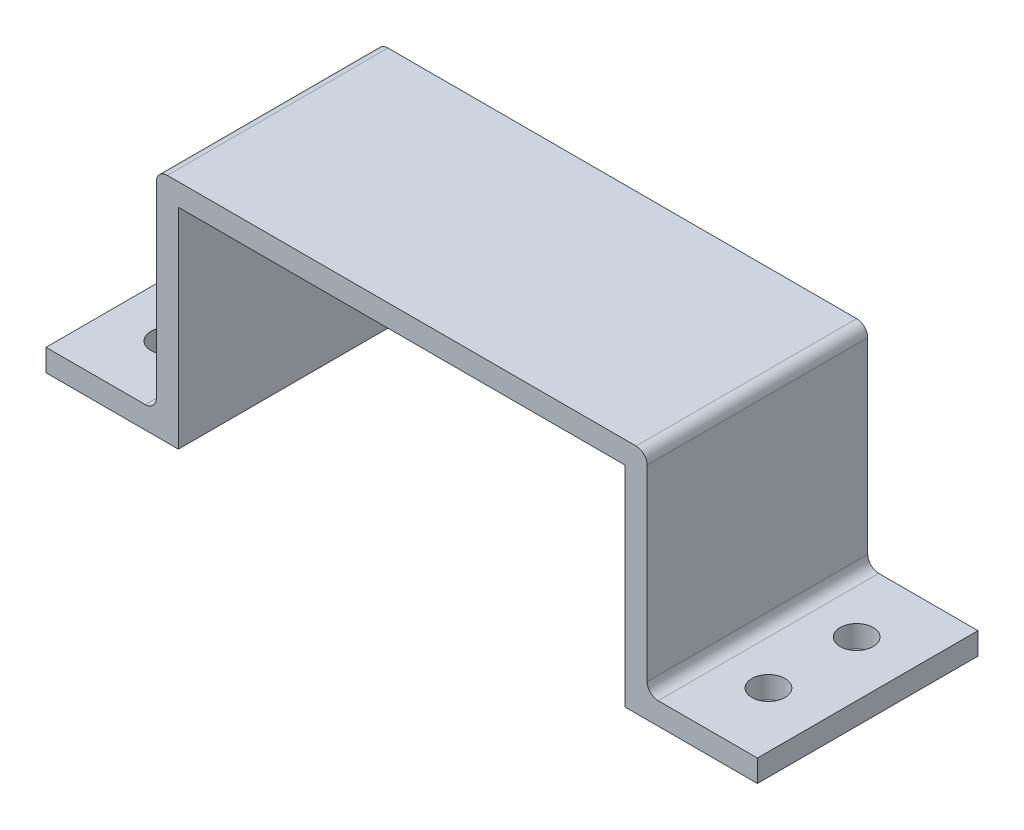
ISO-10303-21;
HEADER;
FILE_DESCRIPTION(('STEP AP214'),'2;1');
FILE_NAME('part.step','',(''),(''),'','','');
FILE_SCHEMA(('AUTOMOTIVE_DESIGN { 1 0 10303 214 1 1 1 1 }'));
ENDSEC;
DATA;
#1=APPLICATION_CONTEXT('core data for automotive mechanical design processes');
#2=APPLICATION_PROTOCOL_DEFINITION('international standard','automotive_design',2000,#1);
#3=PRODUCT_CONTEXT('',#1,'mechanical');
#4=PRODUCT('Part','Part','',(#3));
#5=PRODUCT_RELATED_PRODUCT_CATEGORY('part','',(#4));
#6=PRODUCT_DEFINITION_FORMATION('','',#4);
#7=PRODUCT_DEFINITION_CONTEXT('part definition',#1,'design');
#8=PRODUCT_DEFINITION('design','',#6,#7);
#9=PRODUCT_DEFINITION_SHAPE('','',#8);
#10=(LENGTH_UNIT() NAMED_UNIT(*) SI_UNIT(.MILLI.,.METRE.));
#11=(NAMED_UNIT(*) PLANE_ANGLE_UNIT() SI_UNIT($,.RADIAN.));
#12=(NAMED_UNIT(*) SI_UNIT($,.STERADIAN.) SOLID_ANGLE_UNIT());
#13=UNCERTAINTY_MEASURE_WITH_UNIT(LENGTH_MEASURE(1.E-05),#10,'distance_accuracy_value','');
#14=(GEOMETRIC_REPRESENTATION_CONTEXT(3) GLOBAL_UNCERTAINTY_ASSIGNED_CONTEXT((#13)) GLOBAL_UNIT_ASSIGNED_CONTEXT((#10,
#11,#12)) REPRESENTATION_CONTEXT('',''));
#15=CARTESIAN_POINT('',(0.,0.,0.));
#16=DIRECTION('',(0.,0.,1.));
#17=DIRECTION('',(1.,0.,0.));
#18=AXIS2_PLACEMENT_3D('',#15,#16,#17);
#19=CARTESIAN_POINT('',(-20.25,-1.11022302462516E-13,20.));
#20=DIRECTION('',(0.,1.,0.));
#21=DIRECTION('',(-1.,0.,0.));
#22=AXIS2_PLACEMENT_3D('',#19,#20,#21);
#23=PLANE('',#22);
#24=CARTESIAN_POINT('',(-27.25,-2.22044604925031E-13,5.9999999999998));
#25=DIRECTION('',(0.,1.,0.));
#26=DIRECTION('',(1.,0.,0.));
#27=AXIS2_PLACEMENT_3D('',#24,#25,#26);
#28=CIRCLE('',#27,1.5);
#29=CARTESIAN_POINT('',(-25.75,-2.2210965705538E-13,5.9999999999998));
#30=VERTEX_POINT('',#29);
#31=EDGE_CURVE('E307',#30,#30,#28,.T.);
#32=ORIENTED_EDGE('',*,*,#31,.T.);
#33=EDGE_LOOP('',(#32));
#34=FACE_BOUND('',#33,.T.);
#35=CARTESIAN_POINT('',(-27.2500000000001,-2.22044604925031E-13,13.9999999999998));
#36=DIRECTION('',(0.,1.,0.));
#37=DIRECTION('',(1.,0.,0.));
#38=AXIS2_PLACEMENT_3D('',#35,#36,#37);
#39=CIRCLE('',#38,1.5);
#40=CARTESIAN_POINT('',(-25.7500000000001,-2.2210965705538E-13,13.9999999999998));
#41=VERTEX_POINT('',#40);
#42=EDGE_CURVE('E313',#41,#41,#39,.T.);
#43=ORIENTED_EDGE('',*,*,#42,.T.);
#44=EDGE_LOOP('',(#43));
#45=FACE_BOUND('',#44,.T.);
#46=DIRECTION('',(1.,0.,0.));
#47=VECTOR('',#46,1.);
#48=CARTESIAN_POINT('',(-20.25,-1.11022302462516E-13,0.));
#49=LINE('',#48,#47);
#50=CARTESIAN_POINT('',(-32.25,-2.22044604925031E-13,0.));
#51=VERTEX_POINT('',#50);
#52=CARTESIAN_POINT('',(-20.25,-1.11022302462516E-13,0.));
#53=VERTEX_POINT('',#52);
#54=EDGE_CURVE('E169',#51,#53,#49,.T.);
#55=ORIENTED_EDGE('',*,*,#54,.T.);
#56=DIRECTION('',(0.,0.,-1.));
#57=VECTOR('',#56,1.);
#58=CARTESIAN_POINT('',(-20.25,-1.11022302462516E-13,20.));
#59=LINE('',#58,#57);
#60=CARTESIAN_POINT('',(-20.25,-1.11022302462516E-13,20.));
#61=VERTEX_POINT('',#60);
#62=EDGE_CURVE('E150',#61,#53,#59,.T.);
#63=ORIENTED_EDGE('',*,*,#62,.F.);
#64=DIRECTION('',(1.,0.,0.));
#65=VECTOR('',#64,1.);
#66=CARTESIAN_POINT('',(-20.25,-1.11022302462516E-13,20.));
#67=LINE('',#66,#65);
#68=CARTESIAN_POINT('',(-32.25,-2.22044604925031E-13,20.));
#69=VERTEX_POINT('',#68);
#70=EDGE_CURVE('E156',#69,#61,#67,.T.);
#71=ORIENTED_EDGE('',*,*,#70,.F.);
#72=DIRECTION('',(0.,0.,-1.));
#73=VECTOR('',#72,1.);
#74=CARTESIAN_POINT('',(-32.25,-2.22044604925031E-13,20.));
#75=LINE('',#74,#73);
#76=EDGE_CURVE('E243',#69,#51,#75,.T.);
#77=ORIENTED_EDGE('',*,*,#76,.T.);
#78=EDGE_LOOP('',(#55,#63,#71,#77));
#79=FACE_BOUND('',#78,.T.);
#80=ADVANCED_FACE('F33',(#34,#45,#79),#23,.F.);
#81=CARTESIAN_POINT('',(-20.2500000000001,18.9999999999999,20.));
#82=DIRECTION('',(-1.,0.,0.));
#83=DIRECTION('',(0.,-1.,0.));
#84=AXIS2_PLACEMENT_3D('',#81,#82,#83);
#85=PLANE('',#84);
#86=DIRECTION('',(0.,1.,0.));
#87=VECTOR('',#86,1.);
#88=CARTESIAN_POINT('',(-20.2500000000001,18.9999999999999,0.));
#89=LINE('',#88,#87);
#90=CARTESIAN_POINT('',(-20.2500000000001,18.9999999999999,0.));
#91=VERTEX_POINT('',#90);
#92=EDGE_CURVE('E245',#53,#91,#89,.T.);
#93=ORIENTED_EDGE('',*,*,#92,.T.);
#94=DIRECTION('',(0.,0.,-1.));
#95=VECTOR('',#94,1.);
#96=CARTESIAN_POINT('',(-20.2500000000001,18.9999999999999,20.));
#97=LINE('',#96,#95);
#98=CARTESIAN_POINT('',(-20.2500000000001,18.9999999999999,20.));
#99=VERTEX_POINT('',#98);
#100=EDGE_CURVE('E153',#99,#91,#97,.T.);
#101=ORIENTED_EDGE('',*,*,#100,.F.);
#102=DIRECTION('',(0.,1.,0.));
#103=VECTOR('',#102,1.);
#104=CARTESIAN_POINT('',(-20.2500000000001,18.9999999999999,20.));
#105=LINE('',#104,#103);
#106=EDGE_CURVE('E146',#61,#99,#105,.T.);
#107=ORIENTED_EDGE('',*,*,#106,.F.);
#108=ORIENTED_EDGE('',*,*,#62,.T.);
#109=EDGE_LOOP('',(#93,#101,#107,#108));
#110=FACE_BOUND('',#109,.T.);
#111=ADVANCED_FACE('F148',(#110),#85,.F.);
#112=CARTESIAN_POINT('',(-20.2500000000001,18.9999999999999,20.));
#113=DIRECTION('',(0.,1.,0.));
#114=DIRECTION('',(-1.,0.,0.));
#115=AXIS2_PLACEMENT_3D('',#112,#113,#114);
#116=PLANE('',#115);
#117=DIRECTION('',(1.,0.,0.));
#118=VECTOR('',#117,1.);
#119=CARTESIAN_POINT('',(-20.2500000000001,18.9999999999999,0.));
#120=LINE('',#119,#118);
#121=CARTESIAN_POINT('',(20.25,19.,0.));
#122=VERTEX_POINT('',#121);
#123=EDGE_CURVE('E248',#91,#122,#120,.T.);
#124=ORIENTED_EDGE('',*,*,#123,.T.);
#125=DIRECTION('',(0.,0.,-1.));
#126=VECTOR('',#125,1.);
#127=CARTESIAN_POINT('',(20.25,19.,20.));
#128=LINE('',#127,#126);
#129=CARTESIAN_POINT('',(20.25,19.,20.));
#130=VERTEX_POINT('',#129);
#131=EDGE_CURVE('E175',#130,#122,#128,.T.);
#132=ORIENTED_EDGE('',*,*,#131,.F.);
#133=DIRECTION('',(1.,0.,0.));
#134=VECTOR('',#133,1.);
#135=CARTESIAN_POINT('',(-20.2500000000001,18.9999999999999,20.));
#136=LINE('',#135,#134);
#137=EDGE_CURVE('E155',#99,#130,#136,.T.);
#138=ORIENTED_EDGE('',*,*,#137,.F.);
#139=ORIENTED_EDGE('',*,*,#100,.T.);
#140=EDGE_LOOP('',(#124,#132,#138,#139));
#141=FACE_BOUND('',#140,.T.);
#142=ADVANCED_FACE('F355',(#141),#116,.F.);
#143=CARTESIAN_POINT('',(20.25,19.,20.));
#144=DIRECTION('',(1.,0.,0.));
#145=DIRECTION('',(0.,0.,-1.));
#146=AXIS2_PLACEMENT_3D('',#143,#144,#145);
#147=PLANE('',#146);
#148=DIRECTION('',(0.,-1.,0.));
#149=VECTOR('',#148,1.);
#150=CARTESIAN_POINT('',(20.25,19.,0.));
#151=LINE('',#150,#149);
#152=CARTESIAN_POINT('',(20.25,0.,0.));
#153=VERTEX_POINT('',#152);
#154=EDGE_CURVE('E250',#122,#153,#151,.T.);
#155=ORIENTED_EDGE('',*,*,#154,.T.);
#156=DIRECTION('',(0.,0.,-1.));
#157=VECTOR('',#156,1.);
#158=CARTESIAN_POINT('',(20.25,0.,20.));
#159=LINE('',#158,#157);
#160=CARTESIAN_POINT('',(20.25,0.,20.));
#161=VERTEX_POINT('',#160);
#162=EDGE_CURVE('E273',#161,#153,#159,.T.);
#163=ORIENTED_EDGE('',*,*,#162,.F.);
#164=DIRECTION('',(0.,-1.,0.));
#165=VECTOR('',#164,1.);
#166=CARTESIAN_POINT('',(20.25,19.,20.));
#167=LINE('',#166,#165);
#168=EDGE_CURVE('E282',#130,#161,#167,.T.);
#169=ORIENTED_EDGE('',*,*,#168,.F.);
#170=ORIENTED_EDGE('',*,*,#131,.T.);
#171=EDGE_LOOP('',(#155,#163,#169,#170));
#172=FACE_BOUND('',#171,.T.);
#173=ADVANCED_FACE('F280',(#172),#147,.F.);
#174=CARTESIAN_POINT('',(20.25,0.,20.));
#175=DIRECTION('',(0.,1.,0.));
#176=DIRECTION('',(0.,0.,1.));
#177=AXIS2_PLACEMENT_3D('',#174,#175,#176);
#178=PLANE('',#177);
#179=CARTESIAN_POINT('',(27.25,-2.24646690138997E-13,14.));
#180=DIRECTION('',(0.,1.,0.));
#181=DIRECTION('',(-1.,0.,0.));
#182=AXIS2_PLACEMENT_3D('',#179,#180,#181);
#183=CIRCLE('',#182,1.5);
#184=CARTESIAN_POINT('',(25.75,-2.24581638008647E-13,14.));
#185=VERTEX_POINT('',#184);
#186=EDGE_CURVE('E301',#185,#185,#183,.T.);
#187=ORIENTED_EDGE('',*,*,#186,.T.);
#188=EDGE_LOOP('',(#187));
#189=FACE_BOUND('',#188,.T.);
#190=CARTESIAN_POINT('',(27.25,-2.24646690138997E-13,6.));
#191=DIRECTION('',(0.,1.,0.));
#192=DIRECTION('',(-1.,0.,0.));
#193=AXIS2_PLACEMENT_3D('',#190,#191,#192);
#194=CIRCLE('',#193,1.5);
#195=CARTESIAN_POINT('',(25.75,-2.24581638008647E-13,6.));
#196=VERTEX_POINT('',#195);
#197=EDGE_CURVE('E246',#196,#196,#194,.T.);
#198=ORIENTED_EDGE('',*,*,#197,.T.);
#199=EDGE_LOOP('',(#198));
#200=FACE_BOUND('',#199,.T.);
#201=DIRECTION('',(1.,0.,0.));
#202=VECTOR('',#201,1.);
#203=CARTESIAN_POINT('',(20.25,0.,0.));
#204=LINE('',#203,#202);
#205=CARTESIAN_POINT('',(32.25,0.,0.));
#206=VERTEX_POINT('',#205);
#207=EDGE_CURVE('E252',#153,#206,#204,.T.);
#208=ORIENTED_EDGE('',*,*,#207,.T.);
#209=DIRECTION('',(0.,0.,-1.));
#210=VECTOR('',#209,1.);
#211=CARTESIAN_POINT('',(32.25,0.,20.));
#212=LINE('',#211,#210);
#213=CARTESIAN_POINT('',(32.25,0.,20.));
#214=VERTEX_POINT('',#213);
#215=EDGE_CURVE('E270',#214,#206,#212,.T.);
#216=ORIENTED_EDGE('',*,*,#215,.F.);
#217=DIRECTION('',(1.,0.,0.));
#218=VECTOR('',#217,1.);
#219=CARTESIAN_POINT('',(20.25,0.,20.));
#220=LINE('',#219,#218);
#221=EDGE_CURVE('E293',#161,#214,#220,.T.);
#222=ORIENTED_EDGE('',*,*,#221,.F.);
#223=ORIENTED_EDGE('',*,*,#162,.T.);
#224=EDGE_LOOP('',(#208,#216,#222,#223));
#225=FACE_BOUND('',#224,.T.);
#226=ADVANCED_FACE('F288',(#189,#200,#225),#178,.F.);
#227=CARTESIAN_POINT('',(32.25,0.,20.));
#228=DIRECTION('',(-1.,0.,0.));
#229=DIRECTION('',(0.,0.,1.));
#230=AXIS2_PLACEMENT_3D('',#227,#228,#229);
#231=PLANE('',#230);
#232=DIRECTION('',(0.,1.,0.));
#233=VECTOR('',#232,1.);
#234=CARTESIAN_POINT('',(32.25,0.,0.));
#235=LINE('',#234,#233);
#236=CARTESIAN_POINT('',(32.25,2.,0.));
#237=VERTEX_POINT('',#236);
#238=EDGE_CURVE('E223',#206,#237,#235,.T.);
#239=ORIENTED_EDGE('',*,*,#238,.T.);
#240=DIRECTION('',(0.,0.,-1.));
#241=VECTOR('',#240,1.);
#242=CARTESIAN_POINT('',(32.25,2.,20.));
#243=LINE('',#242,#241);
#244=CARTESIAN_POINT('',(32.25,2.,20.));
#245=VERTEX_POINT('',#244);
#246=EDGE_CURVE('E222',#245,#237,#243,.T.);
#247=ORIENTED_EDGE('',*,*,#246,.F.);
#248=DIRECTION('',(0.,1.,0.));
#249=VECTOR('',#248,1.);
#250=CARTESIAN_POINT('',(32.25,0.,20.));
#251=LINE('',#250,#249);
#252=EDGE_CURVE('E234',#214,#245,#251,.T.);
#253=ORIENTED_EDGE('',*,*,#252,.F.);
#254=ORIENTED_EDGE('',*,*,#215,.T.);
#255=EDGE_LOOP('',(#239,#247,#253,#254));
#256=FACE_BOUND('',#255,.T.);
#257=ADVANCED_FACE('F292',(#256),#231,.F.);
#258=CARTESIAN_POINT('',(32.25,2.,20.));
#259=DIRECTION('',(0.,-1.,0.));
#260=DIRECTION('',(1.,0.,0.));
#261=AXIS2_PLACEMENT_3D('',#258,#259,#260);
#262=PLANE('',#261);
#263=CARTESIAN_POINT('',(27.25,2.,14.));
#264=DIRECTION('',(0.,1.,0.));
#265=DIRECTION('',(-1.,0.,0.));
#266=AXIS2_PLACEMENT_3D('',#263,#264,#265);
#267=CIRCLE('',#266,1.5);
#268=CARTESIAN_POINT('',(25.75,2.,14.));
#269=VERTEX_POINT('',#268);
#270=EDGE_CURVE('E316',#269,#269,#267,.T.);
#271=ORIENTED_EDGE('',*,*,#270,.F.);
#272=EDGE_LOOP('',(#271));
#273=FACE_BOUND('',#272,.T.);
#274=CARTESIAN_POINT('',(27.25,2.,6.));
#275=DIRECTION('',(0.,1.,0.));
#276=DIRECTION('',(-1.,0.,0.));
#277=AXIS2_PLACEMENT_3D('',#274,#275,#276);
#278=CIRCLE('',#277,1.5);
#279=CARTESIAN_POINT('',(25.75,2.,6.));
#280=VERTEX_POINT('',#279);
#281=EDGE_CURVE('E298',#280,#280,#278,.T.);
#282=ORIENTED_EDGE('',*,*,#281,.F.);
#283=EDGE_LOOP('',(#282));
#284=FACE_BOUND('',#283,.T.);
#285=DIRECTION('',(-1.,0.,0.));
#286=VECTOR('',#285,1.);
#287=CARTESIAN_POINT('',(32.25,2.,0.));
#288=LINE('',#287,#286);
#289=CARTESIAN_POINT('',(23.25,2.,0.));
#290=VERTEX_POINT('',#289);
#291=EDGE_CURVE('E212',#237,#290,#288,.T.);
#292=ORIENTED_EDGE('',*,*,#291,.T.);
#293=DIRECTION('',(0.,0.,-1.));
#294=VECTOR('',#293,1.);
#295=CARTESIAN_POINT('',(23.25,2.,20.));
#296=LINE('',#295,#294);
#297=CARTESIAN_POINT('',(23.25,2.,20.));
#298=VERTEX_POINT('',#297);
#299=EDGE_CURVE('E200',#290,#298,#296,.F.);
#300=ORIENTED_EDGE('',*,*,#299,.T.);
#301=DIRECTION('',(-1.,0.,0.));
#302=VECTOR('',#301,1.);
#303=CARTESIAN_POINT('',(32.25,2.,20.));
#304=LINE('',#303,#302);
#305=EDGE_CURVE('E230',#245,#298,#304,.T.);
#306=ORIENTED_EDGE('',*,*,#305,.F.);
#307=ORIENTED_EDGE('',*,*,#246,.T.);
#308=EDGE_LOOP('',(#292,#300,#306,#307));
#309=FACE_BOUND('',#308,.T.);
#310=ADVANCED_FACE('F219',(#273,#284,#309),#262,.F.);
#311=CARTESIAN_POINT('',(22.25,2.,20.));
#312=DIRECTION('',(-1.,0.,0.));
#313=DIRECTION('',(0.,0.,1.));
#314=AXIS2_PLACEMENT_3D('',#311,#312,#313);
#315=PLANE('',#314);
#316=DIRECTION('',(0.,1.,0.));
#317=VECTOR('',#316,1.);
#318=CARTESIAN_POINT('',(22.25,2.,20.));
#319=LINE('',#318,#317);
#320=CARTESIAN_POINT('',(22.25,3.,20.));
#321=VERTEX_POINT('',#320);
#322=CARTESIAN_POINT('',(22.25,20.,20.));
#323=VERTEX_POINT('',#322);
#324=EDGE_CURVE('E227',#321,#323,#319,.T.);
#325=ORIENTED_EDGE('',*,*,#324,.F.);
#326=DIRECTION('',(0.,0.,-1.));
#327=VECTOR('',#326,1.);
#328=CARTESIAN_POINT('',(22.25,3.,0.));
#329=LINE('',#328,#327);
#330=CARTESIAN_POINT('',(22.25,3.,0.));
#331=VERTEX_POINT('',#330);
#332=EDGE_CURVE('E197',#321,#331,#329,.T.);
#333=ORIENTED_EDGE('',*,*,#332,.T.);
#334=DIRECTION('',(0.,1.,0.));
#335=VECTOR('',#334,1.);
#336=CARTESIAN_POINT('',(22.25,2.,0.));
#337=LINE('',#336,#335);
#338=CARTESIAN_POINT('',(22.25,20.,0.));
#339=VERTEX_POINT('',#338);
#340=EDGE_CURVE('E213',#331,#339,#337,.T.);
#341=ORIENTED_EDGE('',*,*,#340,.T.);
#342=DIRECTION('',(0.,0.,-1.));
#343=VECTOR('',#342,1.);
#344=CARTESIAN_POINT('',(22.25,20.,20.));
#345=LINE('',#344,#343);
#346=EDGE_CURVE('E48',#339,#323,#345,.F.);
#347=ORIENTED_EDGE('',*,*,#346,.T.);
#348=EDGE_LOOP('',(#325,#333,#341,#347));
#349=FACE_BOUND('',#348,.T.);
#350=ADVANCED_FACE('F226',(#349),#315,.F.);
#351=CARTESIAN_POINT('',(22.25,21.,20.));
#352=DIRECTION('',(0.,-1.,0.));
#353=DIRECTION('',(1.,0.,0.));
#354=AXIS2_PLACEMENT_3D('',#351,#352,#353);
#355=PLANE('',#354);
#356=DIRECTION('',(-1.,0.,0.));
#357=VECTOR('',#356,1.);
#358=CARTESIAN_POINT('',(22.25,21.,0.));
#359=LINE('',#358,#357);
#360=CARTESIAN_POINT('',(21.25,21.,0.));
#361=VERTEX_POINT('',#360);
#362=CARTESIAN_POINT('',(-21.2500000000001,20.9999999999999,0.));
#363=VERTEX_POINT('',#362);
#364=EDGE_CURVE('E256',#361,#363,#359,.T.);
#365=ORIENTED_EDGE('',*,*,#364,.T.);
#366=DIRECTION('',(0.,0.,-1.));
#367=VECTOR('',#366,1.);
#368=CARTESIAN_POINT('',(-21.2500000000001,20.9999999999999,20.));
#369=LINE('',#368,#367);
#370=CARTESIAN_POINT('',(-21.2500000000001,20.9999999999999,20.));
#371=VERTEX_POINT('',#370);
#372=EDGE_CURVE('E190',#363,#371,#369,.F.);
#373=ORIENTED_EDGE('',*,*,#372,.T.);
#374=DIRECTION('',(-1.,0.,0.));
#375=VECTOR('',#374,1.);
#376=CARTESIAN_POINT('',(22.25,21.,20.));
#377=LINE('',#376,#375);
#378=CARTESIAN_POINT('',(21.25,21.,20.));
#379=VERTEX_POINT('',#378);
#380=EDGE_CURVE('E229',#379,#371,#377,.T.);
#381=ORIENTED_EDGE('',*,*,#380,.F.);
#382=DIRECTION('',(0.,0.,-1.));
#383=VECTOR('',#382,1.);
#384=CARTESIAN_POINT('',(21.25,21.,20.));
#385=LINE('',#384,#383);
#386=EDGE_CURVE('E187',#379,#361,#385,.T.);
#387=ORIENTED_EDGE('',*,*,#386,.T.);
#388=EDGE_LOOP('',(#365,#373,#381,#387));
#389=FACE_BOUND('',#388,.T.);
#390=ADVANCED_FACE('F377',(#389),#355,.F.);
#391=CARTESIAN_POINT('',(-22.25,1.99999999999989,20.));
#392=DIRECTION('',(1.,0.,0.));
#393=DIRECTION('',(0.,1.,0.));
#394=AXIS2_PLACEMENT_3D('',#391,#392,#393);
#395=PLANE('',#394);
#396=DIRECTION('',(0.,-1.,0.));
#397=VECTOR('',#396,1.);
#398=CARTESIAN_POINT('',(-22.25,1.99999999999989,0.));
#399=LINE('',#398,#397);
#400=CARTESIAN_POINT('',(-22.2500000000001,19.9999999999999,0.));
#401=VERTEX_POINT('',#400);
#402=CARTESIAN_POINT('',(-22.25,2.99999999999988,0.));
#403=VERTEX_POINT('',#402);
#404=EDGE_CURVE('E259',#401,#403,#399,.T.);
#405=ORIENTED_EDGE('',*,*,#404,.T.);
#406=DIRECTION('',(0.,0.,-1.));
#407=VECTOR('',#406,1.);
#408=CARTESIAN_POINT('',(-22.25,2.99999999999988,20.));
#409=LINE('',#408,#407);
#410=CARTESIAN_POINT('',(-22.25,2.99999999999988,20.));
#411=VERTEX_POINT('',#410);
#412=EDGE_CURVE('E181',#403,#411,#409,.F.);
#413=ORIENTED_EDGE('',*,*,#412,.T.);
#414=DIRECTION('',(0.,-1.,0.));
#415=VECTOR('',#414,1.);
#416=CARTESIAN_POINT('',(-22.25,1.99999999999989,20.));
#417=LINE('',#416,#415);
#418=CARTESIAN_POINT('',(-22.2500000000001,19.9999999999999,20.));
#419=VERTEX_POINT('',#418);
#420=EDGE_CURVE('E232',#419,#411,#417,.T.);
#421=ORIENTED_EDGE('',*,*,#420,.F.);
#422=DIRECTION('',(0.,0.,-1.));
#423=VECTOR('',#422,1.);
#424=CARTESIAN_POINT('',(-22.2500000000001,19.9999999999999,20.));
#425=LINE('',#424,#423);
#426=EDGE_CURVE('E173',#419,#401,#425,.T.);
#427=ORIENTED_EDGE('',*,*,#426,.T.);
#428=EDGE_LOOP('',(#405,#413,#421,#427));
#429=FACE_BOUND('',#428,.T.);
#430=ADVANCED_FACE('F384',(#429),#395,.F.);
#431=CARTESIAN_POINT('',(-32.25,1.99999999999978,20.));
#432=DIRECTION('',(0.,-1.,0.));
#433=DIRECTION('',(1.,0.,0.));
#434=AXIS2_PLACEMENT_3D('',#431,#432,#433);
#435=PLANE('',#434);
#436=CARTESIAN_POINT('',(-27.25,2.,5.9999999999998));
#437=DIRECTION('',(0.,1.,0.));
#438=DIRECTION('',(1.,0.,0.));
#439=AXIS2_PLACEMENT_3D('',#436,#437,#438);
#440=CIRCLE('',#439,1.5);
#441=CARTESIAN_POINT('',(-25.75,2.,5.9999999999998));
#442=VERTEX_POINT('',#441);
#443=EDGE_CURVE('E304',#442,#442,#440,.T.);
#444=ORIENTED_EDGE('',*,*,#443,.F.);
#445=EDGE_LOOP('',(#444));
#446=FACE_BOUND('',#445,.T.);
#447=CARTESIAN_POINT('',(-27.2500000000001,2.,13.9999999999998));
#448=DIRECTION('',(0.,1.,0.));
#449=DIRECTION('',(1.,0.,0.));
#450=AXIS2_PLACEMENT_3D('',#447,#448,#449);
#451=CIRCLE('',#450,1.5);
#452=CARTESIAN_POINT('',(-25.7500000000001,2.,13.9999999999998));
#453=VERTEX_POINT('',#452);
#454=EDGE_CURVE('E310',#453,#453,#451,.T.);
#455=ORIENTED_EDGE('',*,*,#454,.F.);
#456=EDGE_LOOP('',(#455));
#457=FACE_BOUND('',#456,.T.);
#458=DIRECTION('',(-1.,0.,0.));
#459=VECTOR('',#458,1.);
#460=CARTESIAN_POINT('',(-32.25,1.99999999999978,20.));
#461=LINE('',#460,#459);
#462=CARTESIAN_POINT('',(-23.25,1.99999999999988,20.));
#463=VERTEX_POINT('',#462);
#464=CARTESIAN_POINT('',(-32.25,1.99999999999978,20.));
#465=VERTEX_POINT('',#464);
#466=EDGE_CURVE('E240',#463,#465,#461,.T.);
#467=ORIENTED_EDGE('',*,*,#466,.F.);
#468=DIRECTION('',(0.,0.,-1.));
#469=VECTOR('',#468,1.);
#470=CARTESIAN_POINT('',(-23.25,1.99999999999988,0.));
#471=LINE('',#470,#469);
#472=CARTESIAN_POINT('',(-23.25,1.99999999999988,0.));
#473=VERTEX_POINT('',#472);
#474=EDGE_CURVE('E170',#463,#473,#471,.T.);
#475=ORIENTED_EDGE('',*,*,#474,.T.);
#476=DIRECTION('',(-1.,0.,0.));
#477=VECTOR('',#476,1.);
#478=CARTESIAN_POINT('',(-32.25,1.99999999999978,0.));
#479=LINE('',#478,#477);
#480=CARTESIAN_POINT('',(-32.25,1.99999999999978,0.));
#481=VERTEX_POINT('',#480);
#482=EDGE_CURVE('E262',#473,#481,#479,.T.);
#483=ORIENTED_EDGE('',*,*,#482,.T.);
#484=DIRECTION('',(0.,0.,-1.));
#485=VECTOR('',#484,1.);
#486=CARTESIAN_POINT('',(-32.25,1.99999999999978,20.));
#487=LINE('',#486,#485);
#488=EDGE_CURVE('E266',#465,#481,#487,.T.);
#489=ORIENTED_EDGE('',*,*,#488,.F.);
#490=EDGE_LOOP('',(#467,#475,#483,#489));
#491=FACE_BOUND('',#490,.T.);
#492=ADVANCED_FACE('F390',(#446,#457,#491),#435,.F.);
#493=CARTESIAN_POINT('',(-32.25,-2.22044604925031E-13,20.));
#494=DIRECTION('',(1.,0.,0.));
#495=DIRECTION('',(0.,1.,0.));
#496=AXIS2_PLACEMENT_3D('',#493,#494,#495);
#497=PLANE('',#496);
#498=DIRECTION('',(0.,-1.,0.));
#499=VECTOR('',#498,1.);
#500=CARTESIAN_POINT('',(-32.25,-2.22044604925031E-13,0.));
#501=LINE('',#500,#499);
#502=EDGE_CURVE('E166',#481,#51,#501,.T.);
#503=ORIENTED_EDGE('',*,*,#502,.T.);
#504=ORIENTED_EDGE('',*,*,#76,.F.);
#505=DIRECTION('',(0.,-1.,0.));
#506=VECTOR('',#505,1.);
#507=CARTESIAN_POINT('',(-32.25,-2.22044604925031E-13,20.));
#508=LINE('',#507,#506);
#509=EDGE_CURVE('E162',#465,#69,#508,.T.);
#510=ORIENTED_EDGE('',*,*,#509,.F.);
#511=ORIENTED_EDGE('',*,*,#488,.T.);
#512=EDGE_LOOP('',(#503,#504,#510,#511));
#513=FACE_BOUND('',#512,.T.);
#514=ADVANCED_FACE('F394',(#513),#497,.F.);
#515=CARTESIAN_POINT('',(0.,0.,20.));
#516=DIRECTION('',(0.,0.,-1.));
#517=DIRECTION('',(-1.,0.,0.));
#518=AXIS2_PLACEMENT_3D('',#515,#516,#517);
#519=PLANE('',#518);
#520=ORIENTED_EDGE('',*,*,#380,.T.);
#521=CARTESIAN_POINT('',(-21.2500000000001,19.9999999999999,20.));
#522=DIRECTION('',(0.,0.,-1.));
#523=DIRECTION('',(-1.,0.,0.));
#524=AXIS2_PLACEMENT_3D('',#521,#522,#523);
#525=CIRCLE('',#524,1.);
#526=EDGE_CURVE('E194',#371,#419,#525,.F.);
#527=ORIENTED_EDGE('',*,*,#526,.T.);
#528=ORIENTED_EDGE('',*,*,#420,.T.);
#529=CARTESIAN_POINT('',(-23.25,2.99999999999988,20.));
#530=DIRECTION('',(0.,0.,-1.));
#531=DIRECTION('',(-1.,0.,0.));
#532=AXIS2_PLACEMENT_3D('',#529,#530,#531);
#533=CIRCLE('',#532,1.);
#534=EDGE_CURVE('E204',#411,#463,#533,.T.);
#535=ORIENTED_EDGE('',*,*,#534,.T.);
#536=ORIENTED_EDGE('',*,*,#466,.T.);
#537=ORIENTED_EDGE('',*,*,#509,.T.);
#538=ORIENTED_EDGE('',*,*,#70,.T.);
#539=ORIENTED_EDGE('',*,*,#106,.T.);
#540=ORIENTED_EDGE('',*,*,#137,.T.);
#541=ORIENTED_EDGE('',*,*,#168,.T.);
#542=ORIENTED_EDGE('',*,*,#221,.T.);
#543=ORIENTED_EDGE('',*,*,#252,.T.);
#544=ORIENTED_EDGE('',*,*,#305,.T.);
#545=CARTESIAN_POINT('',(23.25,3.,20.));
#546=DIRECTION('',(0.,0.,-1.));
#547=DIRECTION('',(-1.,0.,0.));
#548=AXIS2_PLACEMENT_3D('',#545,#546,#547);
#549=CIRCLE('',#548,1.);
#550=EDGE_CURVE('E11',#298,#321,#549,.T.);
#551=ORIENTED_EDGE('',*,*,#550,.T.);
#552=ORIENTED_EDGE('',*,*,#324,.T.);
#553=CARTESIAN_POINT('',(21.25,20.,20.));
#554=DIRECTION('',(0.,0.,-1.));
#555=DIRECTION('',(-1.,0.,0.));
#556=AXIS2_PLACEMENT_3D('',#553,#554,#555);
#557=CIRCLE('',#556,1.);
#558=EDGE_CURVE('E192',#323,#379,#557,.F.);
#559=ORIENTED_EDGE('',*,*,#558,.T.);
#560=EDGE_LOOP('',(#520,#527,#528,#535,#536,#537,#538,#539,#540,#541,#542,#543,#544,#551,#552,#559));
#561=FACE_BOUND('',#560,.T.);
#562=ADVANCED_FACE('F160',(#561),#519,.F.);
#563=CARTESIAN_POINT('',(0.,0.,0.));
#564=DIRECTION('',(0.,0.,-1.));
#565=DIRECTION('',(-1.,0.,0.));
#566=AXIS2_PLACEMENT_3D('',#563,#564,#565);
#567=PLANE('',#566);
#568=ORIENTED_EDGE('',*,*,#404,.F.);
#569=CARTESIAN_POINT('',(-21.2500000000001,19.9999999999999,0.));
#570=DIRECTION('',(0.,0.,-1.));
#571=DIRECTION('',(-1.,0.,0.));
#572=AXIS2_PLACEMENT_3D('',#569,#570,#571);
#573=CIRCLE('',#572,1.);
#574=EDGE_CURVE('E185',#401,#363,#573,.T.);
#575=ORIENTED_EDGE('',*,*,#574,.T.);
#576=ORIENTED_EDGE('',*,*,#364,.F.);
#577=CARTESIAN_POINT('',(21.25,20.,0.));
#578=DIRECTION('',(0.,0.,-1.));
#579=DIRECTION('',(-1.,0.,0.));
#580=AXIS2_PLACEMENT_3D('',#577,#578,#579);
#581=CIRCLE('',#580,1.);
#582=EDGE_CURVE('E183',#361,#339,#581,.T.);
#583=ORIENTED_EDGE('',*,*,#582,.T.);
#584=ORIENTED_EDGE('',*,*,#340,.F.);
#585=CARTESIAN_POINT('',(23.25,3.,0.));
#586=DIRECTION('',(0.,0.,-1.));
#587=DIRECTION('',(-1.,0.,0.));
#588=AXIS2_PLACEMENT_3D('',#585,#586,#587);
#589=CIRCLE('',#588,1.);
#590=EDGE_CURVE('E41',#331,#290,#589,.F.);
#591=ORIENTED_EDGE('',*,*,#590,.T.);
#592=ORIENTED_EDGE('',*,*,#291,.F.);
#593=ORIENTED_EDGE('',*,*,#238,.F.);
#594=ORIENTED_EDGE('',*,*,#207,.F.);
#595=ORIENTED_EDGE('',*,*,#154,.F.);
#596=ORIENTED_EDGE('',*,*,#123,.F.);
#597=ORIENTED_EDGE('',*,*,#92,.F.);
#598=ORIENTED_EDGE('',*,*,#54,.F.);
#599=ORIENTED_EDGE('',*,*,#502,.F.);
#600=ORIENTED_EDGE('',*,*,#482,.F.);
#601=CARTESIAN_POINT('',(-23.25,2.99999999999988,0.));
#602=DIRECTION('',(0.,0.,-1.));
#603=DIRECTION('',(-1.,0.,0.));
#604=AXIS2_PLACEMENT_3D('',#601,#602,#603);
#605=CIRCLE('',#604,1.);
#606=EDGE_CURVE('E202',#473,#403,#605,.F.);
#607=ORIENTED_EDGE('',*,*,#606,.T.);
#608=EDGE_LOOP('',(#568,#575,#576,#583,#584,#591,#592,#593,#594,#595,#596,#597,#598,#599,#600,#607));
#609=FACE_BOUND('',#608,.T.);
#610=ADVANCED_FACE('F210',(#609),#567,.T.);
#611=CARTESIAN_POINT('',(-27.2500000000001,-2.22044604925031E-13,13.9999999999998));
#612=DIRECTION('',(0.,1.,0.));
#613=DIRECTION('',(-1.,0.,0.));
#614=AXIS2_PLACEMENT_3D('',#611,#612,#613);
#615=CYLINDRICAL_SURFACE('',#614,1.5);
#616=ORIENTED_EDGE('',*,*,#42,.F.);
#617=EDGE_LOOP('',(#616));
#618=FACE_BOUND('',#617,.T.);
#619=ORIENTED_EDGE('',*,*,#454,.T.);
#620=EDGE_LOOP('',(#619));
#621=FACE_BOUND('',#620,.T.);
#622=ADVANCED_FACE('F344',(#618,#621),#615,.F.);
#623=CARTESIAN_POINT('',(-27.25,-2.22044604925031E-13,5.9999999999998));
#624=DIRECTION('',(0.,1.,0.));
#625=DIRECTION('',(-1.,0.,0.));
#626=AXIS2_PLACEMENT_3D('',#623,#624,#625);
#627=CYLINDRICAL_SURFACE('',#626,1.5);
#628=ORIENTED_EDGE('',*,*,#31,.F.);
#629=EDGE_LOOP('',(#628));
#630=FACE_BOUND('',#629,.T.);
#631=ORIENTED_EDGE('',*,*,#443,.T.);
#632=EDGE_LOOP('',(#631));
#633=FACE_BOUND('',#632,.T.);
#634=ADVANCED_FACE('F338',(#630,#633),#627,.F.);
#635=CARTESIAN_POINT('',(27.25,-2.24646690138997E-13,6.));
#636=DIRECTION('',(0.,1.,0.));
#637=DIRECTION('',(-1.,0.,0.));
#638=AXIS2_PLACEMENT_3D('',#635,#636,#637);
#639=CYLINDRICAL_SURFACE('',#638,1.5);
#640=ORIENTED_EDGE('',*,*,#197,.F.);
#641=EDGE_LOOP('',(#640));
#642=FACE_BOUND('',#641,.T.);
#643=ORIENTED_EDGE('',*,*,#281,.T.);
#644=EDGE_LOOP('',(#643));
#645=FACE_BOUND('',#644,.T.);
#646=ADVANCED_FACE('F328',(#642,#645),#639,.F.);
#647=CARTESIAN_POINT('',(27.25,-2.24646690138997E-13,14.));
#648=DIRECTION('',(0.,1.,0.));
#649=DIRECTION('',(-1.,0.,0.));
#650=AXIS2_PLACEMENT_3D('',#647,#648,#649);
#651=CYLINDRICAL_SURFACE('',#650,1.5);
#652=ORIENTED_EDGE('',*,*,#186,.F.);
#653=EDGE_LOOP('',(#652));
#654=FACE_BOUND('',#653,.T.);
#655=ORIENTED_EDGE('',*,*,#270,.T.);
#656=EDGE_LOOP('',(#655));
#657=FACE_BOUND('',#656,.T.);
#658=ADVANCED_FACE('F324',(#654,#657),#651,.F.);
#659=CARTESIAN_POINT('',(-23.25,2.99999999999988,20.));
#660=DIRECTION('',(0.,0.,1.));
#661=DIRECTION('',(1.,0.,0.));
#662=AXIS2_PLACEMENT_3D('',#659,#660,#661);
#663=CYLINDRICAL_SURFACE('',#662,1.);
#664=ORIENTED_EDGE('',*,*,#534,.F.);
#665=ORIENTED_EDGE('',*,*,#412,.F.);
#666=ORIENTED_EDGE('',*,*,#606,.F.);
#667=ORIENTED_EDGE('',*,*,#474,.F.);
#668=EDGE_LOOP('',(#664,#665,#666,#667));
#669=FACE_BOUND('',#668,.T.);
#670=ADVANCED_FACE('F327',(#669),#663,.F.);
#671=CARTESIAN_POINT('',(-21.2500000000001,19.9999999999999,20.));
#672=DIRECTION('',(0.,0.,-1.));
#673=DIRECTION('',(-1.,0.,0.));
#674=AXIS2_PLACEMENT_3D('',#671,#672,#673);
#675=CYLINDRICAL_SURFACE('',#674,1.);
#676=ORIENTED_EDGE('',*,*,#526,.F.);
#677=ORIENTED_EDGE('',*,*,#372,.F.);
#678=ORIENTED_EDGE('',*,*,#574,.F.);
#679=ORIENTED_EDGE('',*,*,#426,.F.);
#680=EDGE_LOOP('',(#676,#677,#678,#679));
#681=FACE_BOUND('',#680,.T.);
#682=ADVANCED_FACE('F362',(#681),#675,.T.);
#683=CARTESIAN_POINT('',(23.25,3.,20.));
#684=DIRECTION('',(0.,0.,1.));
#685=DIRECTION('',(1.,0.,0.));
#686=AXIS2_PLACEMENT_3D('',#683,#684,#685);
#687=CYLINDRICAL_SURFACE('',#686,1.);
#688=ORIENTED_EDGE('',*,*,#550,.F.);
#689=ORIENTED_EDGE('',*,*,#299,.F.);
#690=ORIENTED_EDGE('',*,*,#590,.F.);
#691=ORIENTED_EDGE('',*,*,#332,.F.);
#692=EDGE_LOOP('',(#688,#689,#690,#691));
#693=FACE_BOUND('',#692,.T.);
#694=ADVANCED_FACE('F225',(#693),#687,.F.);
#695=CARTESIAN_POINT('',(21.25,20.,20.));
#696=DIRECTION('',(0.,0.,-1.));
#697=DIRECTION('',(-1.,0.,0.));
#698=AXIS2_PLACEMENT_3D('',#695,#696,#697);
#699=CYLINDRICAL_SURFACE('',#698,1.);
#700=ORIENTED_EDGE('',*,*,#558,.F.);
#701=ORIENTED_EDGE('',*,*,#346,.F.);
#702=ORIENTED_EDGE('',*,*,#582,.F.);
#703=ORIENTED_EDGE('',*,*,#386,.F.);
#704=EDGE_LOOP('',(#700,#701,#702,#703));
#705=FACE_BOUND('',#704,.T.);
#706=ADVANCED_FACE('F35',(#705),#699,.T.);
#707=CLOSED_SHELL('',(#80,#111,#142,#173,#226,#257,#310,#350,#390,#430,#492,#514,#562,#610,#622,
#634,#646,#658,#670,#682,#694,#706));
#708=MANIFOLD_SOLID_BREP('B2',#707);
#709=ADVANCED_BREP_SHAPE_REPRESENTATION('',(#18,#708),#14);
#710=SHAPE_DEFINITION_REPRESENTATION(#9,#709);
ENDSEC;
END-ISO-10303-21;
